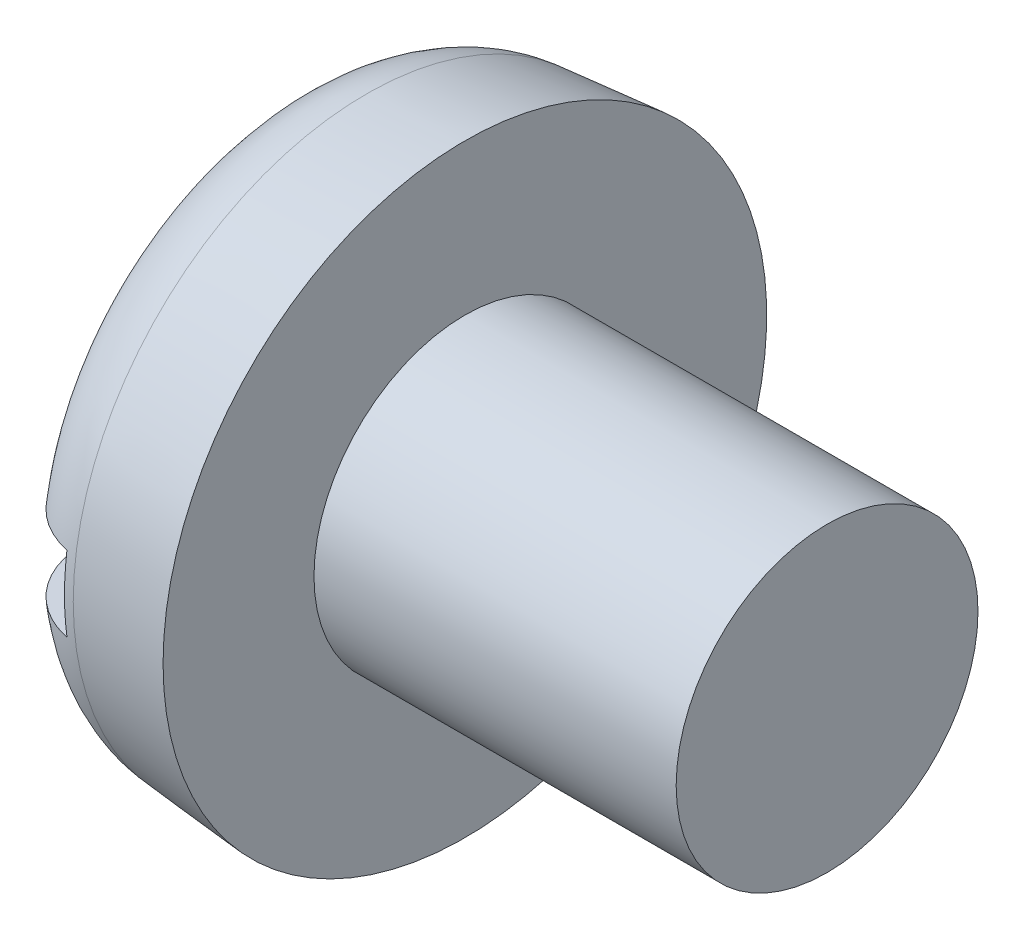
ISO-10303-21;
HEADER;
FILE_DESCRIPTION(('STEP AP214'),'2;1');
FILE_NAME('part.step','',(''),(''),'','','');
FILE_SCHEMA(('AUTOMOTIVE_DESIGN { 1 0 10303 214 1 1 1 1 }'));
ENDSEC;
DATA;
#1=APPLICATION_CONTEXT('core data for automotive mechanical design processes');
#2=APPLICATION_PROTOCOL_DEFINITION('international standard','automotive_design',2000,#1);
#3=PRODUCT_CONTEXT('',#1,'mechanical');
#4=PRODUCT('Part','Part','',(#3));
#5=PRODUCT_RELATED_PRODUCT_CATEGORY('part','',(#4));
#6=PRODUCT_DEFINITION_FORMATION('','',#4);
#7=PRODUCT_DEFINITION_CONTEXT('part definition',#1,'design');
#8=PRODUCT_DEFINITION('design','',#6,#7);
#9=PRODUCT_DEFINITION_SHAPE('','',#8);
#10=(LENGTH_UNIT() NAMED_UNIT(*) SI_UNIT(.MILLI.,.METRE.));
#11=(NAMED_UNIT(*) PLANE_ANGLE_UNIT() SI_UNIT($,.RADIAN.));
#12=(NAMED_UNIT(*) SI_UNIT($,.STERADIAN.) SOLID_ANGLE_UNIT());
#13=UNCERTAINTY_MEASURE_WITH_UNIT(LENGTH_MEASURE(1.E-05),#10,'distance_accuracy_value','');
#14=(GEOMETRIC_REPRESENTATION_CONTEXT(3) GLOBAL_UNCERTAINTY_ASSIGNED_CONTEXT((#13)) GLOBAL_UNIT_ASSIGNED_CONTEXT((#10,
#11,#12)) REPRESENTATION_CONTEXT('',''));
#15=CARTESIAN_POINT('',(0.,0.,0.));
#16=DIRECTION('',(0.,0.,1.));
#17=DIRECTION('',(1.,0.,0.));
#18=AXIS2_PLACEMENT_3D('',#15,#16,#17);
#19=CARTESIAN_POINT('',(0.,0.,0.));
#20=DIRECTION('',(-1.,0.,0.));
#21=DIRECTION('',(0.,0.,1.));
#22=AXIS2_PLACEMENT_3D('',#19,#20,#21);
#23=PLANE('',#22);
#24=DIRECTION('',(0.,0.,-1.));
#25=VECTOR('',#24,1.);
#26=CARTESIAN_POINT('',(0.,1.25,10.));
#27=LINE('',#26,#25);
#28=CARTESIAN_POINT('',(0.,1.25,6.60890143188702));
#29=VERTEX_POINT('',#28);
#30=CARTESIAN_POINT('',(0.,1.25,-6.60890143188702));
#31=VERTEX_POINT('',#30);
#32=EDGE_CURVE('E85',#29,#31,#27,.T.);
#33=ORIENTED_EDGE('',*,*,#32,.F.);
#34=CARTESIAN_POINT('',(0.,0.,0.));
#35=DIRECTION('',(-1.,0.,0.));
#36=DIRECTION('',(0.,0.,1.));
#37=AXIS2_PLACEMENT_3D('',#34,#35,#36);
#38=CIRCLE('',#37,6.72607449679219);
#39=EDGE_CURVE('E91',#29,#31,#38,.T.);
#40=ORIENTED_EDGE('',*,*,#39,.T.);
#41=EDGE_LOOP('',(#33,#40));
#42=FACE_BOUND('',#41,.T.);
#43=ADVANCED_FACE('F32',(#42),#23,.T.);
#44=CARTESIAN_POINT('',(-25.4,0.,0.));
#45=DIRECTION('',(-1.,0.,0.));
#46=DIRECTION('',(0.,0.,1.));
#47=AXIS2_PLACEMENT_3D('',#44,#45,#46);
#48=CYLINDRICAL_SURFACE('',#47,5.);
#49=CARTESIAN_POINT('',(18.,0.,0.));
#50=DIRECTION('',(-1.,0.,0.));
#51=DIRECTION('',(0.,0.,1.));
#52=AXIS2_PLACEMENT_3D('',#49,#50,#51);
#53=CIRCLE('',#52,5.);
#54=CARTESIAN_POINT('',(18.,0.,5.));
#55=VERTEX_POINT('',#54);
#56=EDGE_CURVE('E92',#55,#55,#53,.T.);
#57=ORIENTED_EDGE('',*,*,#56,.T.);
#58=EDGE_LOOP('',(#57));
#59=FACE_BOUND('',#58,.T.);
#60=CARTESIAN_POINT('',(6.,0.,0.));
#61=DIRECTION('',(-1.,0.,0.));
#62=DIRECTION('',(0.,0.,1.));
#63=AXIS2_PLACEMENT_3D('',#60,#61,#62);
#64=CIRCLE('',#63,5.);
#65=CARTESIAN_POINT('',(6.,0.,5.));
#66=VERTEX_POINT('',#65);
#67=EDGE_CURVE('E149',#66,#66,#64,.T.);
#68=ORIENTED_EDGE('',*,*,#67,.F.);
#69=EDGE_LOOP('',(#68));
#70=FACE_BOUND('',#69,.T.);
#71=ADVANCED_FACE('F137',(#59,#70),#48,.T.);
#72=CARTESIAN_POINT('',(18.,5.,0.));
#73=DIRECTION('',(1.,0.,0.));
#74=DIRECTION('',(0.,0.,-1.));
#75=AXIS2_PLACEMENT_3D('',#72,#73,#74);
#76=PLANE('',#75);
#77=ORIENTED_EDGE('',*,*,#56,.F.);
#78=EDGE_LOOP('',(#77));
#79=FACE_BOUND('',#78,.T.);
#80=ADVANCED_FACE('F135',(#79),#76,.T.);
#81=DIRECTION('',(0.,0.,1.));
#82=VECTOR('',#81,1.);
#83=CARTESIAN_POINT('',(0.,-1.25,-10.));
#84=LINE('',#83,#82);
#85=CARTESIAN_POINT('',(0.,-1.25,-6.60890143188702));
#86=VERTEX_POINT('',#85);
#87=CARTESIAN_POINT('',(0.,-1.25,6.60890143188702));
#88=VERTEX_POINT('',#87);
#89=EDGE_CURVE('E76',#86,#88,#84,.T.);
#90=ORIENTED_EDGE('',*,*,#89,.F.);
#91=EDGE_CURVE('E83',#86,#88,#38,.T.);
#92=ORIENTED_EDGE('',*,*,#91,.T.);
#93=EDGE_LOOP('',(#90,#92));
#94=FACE_BOUND('',#93,.T.);
#95=ADVANCED_FACE('F82',(#94),#23,.T.);
#96=CARTESIAN_POINT('',(0.,0.,0.));
#97=DIRECTION('',(1.,0.,0.));
#98=DIRECTION('',(0.,0.,-1.));
#99=AXIS2_PLACEMENT_3D('',#96,#97,#98);
#100=CONICAL_SURFACE('',#99,9.47506801884446,0.0872664625997167);
#101=CARTESIAN_POINT('',(2.73853277175704,0.,0.));
#102=DIRECTION('',(-1.,0.,0.));
#103=DIRECTION('',(0.,0.,1.));
#104=AXIS2_PLACEMENT_3D('',#101,#102,#103);
#105=CIRCLE('',#104,9.71465859106742);
#106=CARTESIAN_POINT('',(2.73853277175704,0.,9.71465859106742));
#107=VERTEX_POINT('',#106);
#108=EDGE_CURVE('E95',#107,#107,#105,.F.);
#109=ORIENTED_EDGE('',*,*,#108,.T.);
#110=EDGE_LOOP('',(#109));
#111=FACE_BOUND('',#110,.T.);
#112=CARTESIAN_POINT('',(6.,0.,0.));
#113=DIRECTION('',(-1.,0.,0.));
#114=DIRECTION('',(0.,0.,1.));
#115=AXIS2_PLACEMENT_3D('',#112,#113,#114);
#116=CIRCLE('',#115,10.);
#117=CARTESIAN_POINT('',(6.,0.,10.));
#118=VERTEX_POINT('',#117);
#119=EDGE_CURVE('E97',#118,#118,#116,.T.);
#120=ORIENTED_EDGE('',*,*,#119,.T.);
#121=EDGE_LOOP('',(#120));
#122=FACE_BOUND('',#121,.T.);
#123=ADVANCED_FACE('F128',(#111,#122),#100,.T.);
#124=CARTESIAN_POINT('',(6.,5.,0.));
#125=DIRECTION('',(-1.,0.,0.));
#126=DIRECTION('',(0.,0.,1.));
#127=AXIS2_PLACEMENT_3D('',#124,#125,#126);
#128=PLANE('',#127);
#129=ORIENTED_EDGE('',*,*,#119,.F.);
#130=EDGE_LOOP('',(#129));
#131=FACE_BOUND('',#130,.T.);
#132=ORIENTED_EDGE('',*,*,#67,.T.);
#133=EDGE_LOOP('',(#132));
#134=FACE_BOUND('',#133,.T.);
#135=ADVANCED_FACE('F124',(#131,#134),#128,.F.);
#136=CARTESIAN_POINT('',(3.,0.,0.));
#137=DIRECTION('',(-1.,0.,0.));
#138=DIRECTION('',(0.,0.,1.));
#139=AXIS2_PLACEMENT_3D('',#136,#137,#138);
#140=TOROIDAL_SURFACE('',#139,6.72607449679219,3.);
#141=CARTESIAN_POINT('',(0.913950370637109,1.25,-8.79369083128901));
#142=CARTESIAN_POINT('',(1.03407751130377,1.25,-8.91107806132142));
#143=CARTESIAN_POINT('',(1.16414710380207,1.25,-9.0184570237587));
#144=CARTESIAN_POINT('',(1.44055548040903,1.25,-9.20996884049512));
#145=CARTESIAN_POINT('',(1.58691212679928,1.25,-9.29407581260138));
#146=CARTESIAN_POINT('',(1.89167269673039,1.25,-9.43645928294605));
#147=CARTESIAN_POINT('',(2.0500739357299,1.25,-9.49474151743692));
#148=CARTESIAN_POINT('',(2.37439631699175,1.25,-9.58375548275899));
#149=CARTESIAN_POINT('',(2.54031567881057,1.25,-9.61449370111562));
#150=CARTESIAN_POINT('',(2.87435662350507,1.25,-9.64747712365223));
#151=CARTESIAN_POINT('',(3.04246808407952,1.25,-9.64982487020966));
#152=CARTESIAN_POINT('',(3.37669612695632,1.25,-9.62622242478128));
#153=CARTESIAN_POINT('',(3.54281266818427,1.25,-9.60027165114961));
#154=CARTESIAN_POINT('',(3.8681098663374,1.25,-9.52088746536866));
#155=CARTESIAN_POINT('',(4.02729932442789,1.25,-9.46749010098248));
#156=CARTESIAN_POINT('',(4.33448631065542,1.25,-9.33479520222095));
#157=CARTESIAN_POINT('',(4.48248380541743,1.25,-9.25549759061341));
#158=CARTESIAN_POINT('',(4.76352766880619,1.25,-9.07306642098115));
#159=CARTESIAN_POINT('',(4.89653363801115,1.25,-8.96987064210604));
#160=CARTESIAN_POINT('',(5.14347241464919,1.25,-8.74274923983966));
#161=CARTESIAN_POINT('',(5.25740480355147,1.25,-8.61882316168355));
#162=CARTESIAN_POINT('',(5.46381187653993,1.25,-8.35290133451653));
#163=CARTESIAN_POINT('',(5.5561381014362,1.25,-8.21079038299477));
#164=CARTESIAN_POINT('',(5.71591382641562,1.25,-7.91321813905344));
#165=CARTESIAN_POINT('',(5.78336219693195,1.25,-7.75775624083566));
#166=CARTESIAN_POINT('',(5.89229296716758,1.25,-7.43609765141166));
#167=CARTESIAN_POINT('',(5.93348408672347,1.25,-7.26980235780456));
#168=CARTESIAN_POINT('',(5.98780094027136,1.25,-6.93269546295164));
#169=CARTESIAN_POINT('',(6.00092472704265,1.25,-6.76188354918954));
#170=CARTESIAN_POINT('',(5.99895954791929,1.25,-6.41790932325796));
#171=CARTESIAN_POINT('',(5.98345242956866,1.25,-6.24474942607715));
#172=CARTESIAN_POINT('',(5.9240547697785,1.25,-5.90336911532406));
#173=CARTESIAN_POINT('',(5.88016160637908,1.25,-5.73514915954457));
#174=CARTESIAN_POINT('',(5.76444528394465,1.25,-5.40563318621168));
#175=CARTESIAN_POINT('',(5.69219500815642,1.25,-5.24448707939763));
#176=CARTESIAN_POINT('',(5.52187152839524,1.25,-4.93645275143297));
#177=CARTESIAN_POINT('',(5.42379531610836,1.25,-4.78956619402467));
#178=CARTESIAN_POINT('',(5.20362037162036,1.25,-4.51322087856389));
#179=CARTESIAN_POINT('',(5.08134720862953,1.25,-4.38390089873516));
#180=CARTESIAN_POINT('',(4.81646755611421,1.25,-4.14804563021094));
#181=CARTESIAN_POINT('',(4.67386150920101,1.25,-4.04150984566958));
#182=CARTESIAN_POINT('',(4.37493583595242,1.25,-3.85675206013619));
#183=CARTESIAN_POINT('',(4.21891607377839,1.25,-3.7780461149527));
#184=CARTESIAN_POINT('',(3.89540554802636,1.25,-3.64953247185818));
#185=CARTESIAN_POINT('',(3.72792001916016,1.25,-3.59971168347483));
#186=CARTESIAN_POINT('',(3.39522326999832,1.25,-3.53305783519263));
#187=CARTESIAN_POINT('',(3.23031745969932,1.25,-3.51469914474808));
#188=CARTESIAN_POINT('',(2.89985413069661,1.25,-3.50709369984232));
#189=CARTESIAN_POINT('',(2.73429676976369,1.25,-3.51784028444378));
#190=CARTESIAN_POINT('',(2.41348778299921,1.25,-3.56699036741715));
#191=CARTESIAN_POINT('',(2.25807967950541,1.25,-3.60438488121367));
#192=CARTESIAN_POINT('',(1.95549755522285,1.25,-3.70411822509696));
#193=CARTESIAN_POINT('',(1.80832473539396,1.25,-3.76646068261804));
#194=CARTESIAN_POINT('',(1.52239485860973,1.25,-3.91558892224511));
#195=CARTESIAN_POINT('',(1.38392868870966,1.25,-4.00293114892807));
#196=CARTESIAN_POINT('',(1.12266061046804,1.25,-4.19852761274049));
#197=CARTESIAN_POINT('',(0.999862193562184,1.25,-4.30678649751603));
#198=CARTESIAN_POINT('',(0.766801818650841,1.25,-4.54725082549057));
#199=CARTESIAN_POINT('',(0.657519290944068,1.25,-4.68040649001058));
#200=CARTESIAN_POINT('',(0.462072911149952,1.25,-4.96272965499895));
#201=CARTESIAN_POINT('',(0.375912926633934,1.25,-5.11189982828501));
#202=CARTESIAN_POINT('',(0.226781782891288,1.25,-5.42688300195218));
#203=CARTESIAN_POINT('',(0.164574583157254,1.25,-5.59305850661094));
#204=CARTESIAN_POINT('',(0.0689385441878412,1.25,-5.93349549898356));
#205=CARTESIAN_POINT('',(0.0355092666844694,1.25,-6.10775686351272));
#206=CARTESIAN_POINT('',(-0.00141343103443004,1.25,-6.45940175701318));
#207=CARTESIAN_POINT('',(-0.00491262898250947,1.25,-6.636784676771));
#208=CARTESIAN_POINT('',(0.0183732174024274,1.25,-6.98960681097475));
#209=CARTESIAN_POINT('',(0.045163929218162,1.25,-7.16504565546567));
#210=CARTESIAN_POINT('',(0.127908491877246,1.25,-7.50633395335969));
#211=CARTESIAN_POINT('',(0.183455825943161,1.25,-7.67228216500717));
#212=CARTESIAN_POINT('',(0.322041684811761,1.25,-7.99211018071299));
#213=CARTESIAN_POINT('',(0.40504415457883,1.25,-8.14600548697529));
#214=CARTESIAN_POINT('',(0.560173287365899,1.25,-8.38236701226094));
#215=CARTESIAN_POINT('',(0.62466285593324,1.25,-8.46994047614879));
#216=CARTESIAN_POINT('',(0.762698375107589,1.25,-8.63763545899658));
#217=CARTESIAN_POINT('',(0.836244236403102,1.25,-8.71775705143182));
#218=CARTESIAN_POINT('',(0.913950370637109,1.25,-8.79369083128901));
#219=B_SPLINE_CURVE_WITH_KNOTS('',3,(#141,#142,#143,#144,#145,#146,#147,#148,#149,#150,#151,
#152,#153,#154,#155,#156,#157,#158,#159,#160,#161,#162,#163,#164,#165,#166,#167,#168,#169,#170,
#171,#172,#173,#174,#175,#176,#177,#178,#179,#180,#181,#182,#183,#184,#185,#186,#187,#188,#189,
#190,#191,#192,#193,#194,#195,#196,#197,#198,#199,#200,#201,#202,#203,#204,#205,#206,#207,#208,
#209,#210,#211,#212,#213,#214,#215,#216,#217,#218),.UNSPECIFIED.,.T.,.F.,(4,2,2,2,2,2,2,2,2,2,2,
2,2,2,2,2,2,2,2,2,2,2,2,2,2,2,2,2,2,2,2,2,2,2,2,2,2,2,4),(0.,0.503484154162442,1.00752603326543,
1.51145589718797,2.01526703776391,2.51725793779356,3.01925915590461,3.52060273469954,
4.02194780846897,4.52461314965636,5.02728951936335,5.53332459375003,6.0393826415844,
6.55096110344102,7.0625750558047,7.58172027137345,8.10091344615562,8.62824690708603,
9.15564182123356,9.68698702152262,10.2183206571223,10.7398986755371,11.2612401347262,
11.7564997004828,12.2516459323454,12.7289772083202,13.2063779135576,13.6953635033286,
14.1844578700852,14.6988978597672,15.2134238432352,15.7432176241734,16.2730033365734,
16.8026867763,17.3324693404094,17.8549592704749,18.3767657548957,18.7024556269399,
19.0281422873475),.UNSPECIFIED.);
#220=CARTESIAN_POINT('',(2.4,1.25,-9.58429232182582));
#221=VERTEX_POINT('',#220);
#222=EDGE_CURVE('E11',#31,#221,#219,.T.);
#223=ORIENTED_EDGE('',*,*,#222,.F.);
#224=ORIENTED_EDGE('',*,*,#39,.F.);
#225=CARTESIAN_POINT('',(1.42400410544714,1.25,3.98178611401085));
#226=CARTESIAN_POINT('',(1.5612667229127,1.25,3.89297012542962));
#227=CARTESIAN_POINT('',(1.70580035016197,1.25,3.81523437534233));
#228=CARTESIAN_POINT('',(2.00584163029249,1.25,3.68474127465647));
#229=CARTESIAN_POINT('',(2.16135542333277,1.25,3.63199802914649));
#230=CARTESIAN_POINT('',(2.47937427381411,1.25,3.55367301119874));
#231=CARTESIAN_POINT('',(2.64188954131776,1.25,3.52813240569149));
#232=CARTESIAN_POINT('',(2.96885435771794,1.25,3.50557748557998));
#233=CARTESIAN_POINT('',(3.13330332914991,1.25,3.50855486037059));
#234=CARTESIAN_POINT('',(3.45489323825768,1.25,3.54240853089129));
#235=CARTESIAN_POINT('',(3.61211260636177,1.25,3.57254854261386));
#236=CARTESIAN_POINT('',(3.91940624931825,1.25,3.65837971181245));
#237=CARTESIAN_POINT('',(4.06947936666885,1.25,3.71407499312618));
#238=CARTESIAN_POINT('',(4.36105131253355,1.25,3.84997531509812));
#239=CARTESIAN_POINT('',(4.50236952426379,1.25,3.93056672198312));
#240=CARTESIAN_POINT('',(4.77037282131814,1.25,4.1132046998502));
#241=CARTESIAN_POINT('',(4.89705478522829,1.25,4.21525583442383));
#242=CARTESIAN_POINT('',(5.13904911182896,1.25,4.44362846352343));
#243=CARTESIAN_POINT('',(5.25343578953125,1.25,4.57093155457726));
#244=CARTESIAN_POINT('',(5.46008362867014,1.25,4.84238649557124));
#245=CARTESIAN_POINT('',(5.55234077331088,1.25,4.98654139728032));
#246=CARTESIAN_POINT('',(5.71512091475504,1.25,5.29301673364416));
#247=CARTESIAN_POINT('',(5.78479444490038,1.25,5.45578930160224));
#248=CARTESIAN_POINT('',(5.89593523694821,1.25,5.79070335295831));
#249=CARTESIAN_POINT('',(5.93740130855529,1.25,5.96284523139051));
#250=CARTESIAN_POINT('',(5.99085637776574,1.25,6.31223598795774));
#251=CARTESIAN_POINT('',(6.00274901050106,1.25,6.48949966253518));
#252=CARTESIAN_POINT('',(5.99618345776841,1.25,6.84347053478164));
#253=CARTESIAN_POINT('',(5.97772699776386,1.25,7.02017776351449));
#254=CARTESIAN_POINT('',(5.91120016365612,1.25,7.3655056514184));
#255=CARTESIAN_POINT('',(5.86352491612468,1.25,7.53420237810825));
#256=CARTESIAN_POINT('',(5.74006872714877,1.25,7.86098193149343));
#257=CARTESIAN_POINT('',(5.66429014861451,1.25,8.01906564920444));
#258=CARTESIAN_POINT('',(5.48810579850209,1.25,8.31744548780965));
#259=CARTESIAN_POINT('',(5.38811325325753,1.25,8.4579856429053));
#260=CARTESIAN_POINT('',(5.16566608133882,1.25,8.71999862859805));
#261=CARTESIAN_POINT('',(5.04321309685082,1.25,8.84147285198905));
#262=CARTESIAN_POINT('',(4.78105062596314,1.25,9.06026678761757));
#263=CARTESIAN_POINT('',(4.6415850635739,1.25,9.1578788435105));
#264=CARTESIAN_POINT('',(4.34813222762841,1.25,9.32806433190163));
#265=CARTESIAN_POINT('',(4.19414569661798,1.25,9.40063904382905));
#266=CARTESIAN_POINT('',(3.87745295144188,1.25,9.5180728669798));
#267=CARTESIAN_POINT('',(3.71483300145876,1.25,9.56316469943591));
#268=CARTESIAN_POINT('',(3.38431824439367,1.25,9.6252741915853));
#269=CARTESIAN_POINT('',(3.21642359332601,1.25,9.64229268083246));
#270=CARTESIAN_POINT('',(2.88090253851376,1.25,9.64774078403327));
#271=CARTESIAN_POINT('',(2.71327812808542,1.25,9.63629403619727));
#272=CARTESIAN_POINT('',(2.38233537100995,1.25,9.58540890722111));
#273=CARTESIAN_POINT('',(2.21901698410528,1.25,9.54597078787211));
#274=CARTESIAN_POINT('',(1.90136639243121,1.25,9.440278442531));
#275=CARTESIAN_POINT('',(1.74703114200579,1.25,9.37403336650221));
#276=CARTESIAN_POINT('',(1.45161989000497,1.25,9.21666160296893));
#277=CARTESIAN_POINT('',(1.31054399833104,1.25,9.12553470925355));
#278=CARTESIAN_POINT('',(1.04508569400981,1.25,8.92067026270615));
#279=CARTESIAN_POINT('',(0.920765151968029,1.25,8.80685255977891));
#280=CARTESIAN_POINT('',(0.69282275255856,1.25,8.56010291651837));
#281=CARTESIAN_POINT('',(0.58920150731778,1.25,8.42717041111526));
#282=CARTESIAN_POINT('',(0.404709376546608,1.25,8.14489607538399));
#283=CARTESIAN_POINT('',(0.324019714622909,1.25,7.99543583255841));
#284=CARTESIAN_POINT('',(0.188546673254066,1.25,7.68520850953716));
#285=CARTESIAN_POINT('',(0.133764680919071,1.25,7.52444082446439));
#286=CARTESIAN_POINT('',(0.0509263008805422,1.25,7.19412294861733));
#287=CARTESIAN_POINT('',(0.0231968290617239,1.25,7.02449081394862));
#288=CARTESIAN_POINT('',(-0.00385005373943917,1.25,6.68298800418002));
#289=CARTESIAN_POINT('',(-0.00316643097126078,1.25,6.51111724786003));
#290=CARTESIAN_POINT('',(0.02659266570176,1.25,6.16720755358592));
#291=CARTESIAN_POINT('',(0.0561017342399292,1.25,5.99520616080172));
#292=CARTESIAN_POINT('',(0.143149953845394,1.25,5.65840060390682));
#293=CARTESIAN_POINT('',(0.200698360477521,1.25,5.49359883592269));
#294=CARTESIAN_POINT('',(0.343213197801992,1.25,5.17328528078032));
#295=CARTESIAN_POINT('',(0.428585959112109,1.25,5.01795437994385));
#296=CARTESIAN_POINT('',(0.624063068990159,1.25,4.72386676316716));
#297=CARTESIAN_POINT('',(0.734143092105619,1.25,4.58509394945501));
#298=CARTESIAN_POINT('',(0.939954204163414,1.25,4.36648585706974));
#299=CARTESIAN_POINT('',(1.03018849186778,1.25,4.28140949294303));
#300=CARTESIAN_POINT('',(1.2202259805025,1.25,4.12269833615171));
#301=CARTESIAN_POINT('',(1.32002902167376,1.25,4.04906335251657));
#302=CARTESIAN_POINT('',(1.42400410544714,1.25,3.98178611401085));
#303=B_SPLINE_CURVE_WITH_KNOTS('',3,(#225,#226,#227,#228,#229,#230,#231,#232,#233,#234,#235,
#236,#237,#238,#239,#240,#241,#242,#243,#244,#245,#246,#247,#248,#249,#250,#251,#252,#253,#254,
#255,#256,#257,#258,#259,#260,#261,#262,#263,#264,#265,#266,#267,#268,#269,#270,#271,#272,#273,
#274,#275,#276,#277,#278,#279,#280,#281,#282,#283,#284,#285,#286,#287,#288,#289,#290,#291,#292,
#293,#294,#295,#296,#297,#298,#299,#300,#301,#302),.UNSPECIFIED.,.T.,.F.,(4,2,2,2,2,2,2,2,2,2,2,
2,2,2,2,2,2,2,2,2,2,2,2,2,2,2,2,2,2,2,2,2,2,2,2,2,2,2,4),(0.,0.490052283600538,
0.980380810918269,1.47145032380725,1.96237673537656,2.44038333120541,2.91846708979897,
3.40437848125001,3.89039331053407,4.40152059741941,4.91274059041699,5.44141242118504,
5.97010655940861,6.50052119996867,7.03090568544548,7.55427135175516,8.07759302378493,
8.59254557427598,9.10746048921212,9.61570935727125,10.1239322495399,10.6277895192064,
11.1316318998646,11.633289676473,12.1349427613559,12.6364247622586,13.1379109193765,
13.6412008900273,14.1445057419441,14.6516840179981,15.1588894455684,15.6721509466047,
16.1854311215946,16.7065528926029,17.2278467984661,17.7571227257298,18.2858798243091,
18.657095809829,19.0283055986377),.UNSPECIFIED.);
#304=CARTESIAN_POINT('',(2.4,1.25,9.58429232182582));
#305=VERTEX_POINT('',#304);
#306=EDGE_CURVE('E109',#305,#29,#303,.T.);
#307=ORIENTED_EDGE('',*,*,#306,.F.);
#308=CARTESIAN_POINT('',(2.4,0.,0.));
#309=DIRECTION('',(-1.,0.,0.));
#310=DIRECTION('',(0.,0.,1.));
#311=AXIS2_PLACEMENT_3D('',#308,#309,#310);
#312=CIRCLE('',#311,9.665462188132);
#313=CARTESIAN_POINT('',(2.4,-1.25,9.58429232182582));
#314=VERTEX_POINT('',#313);
#315=EDGE_CURVE('E103',#305,#314,#312,.F.);
#316=ORIENTED_EDGE('',*,*,#315,.T.);
#317=CARTESIAN_POINT('',(1.42400410544714,-1.25,3.98178611401085));
#318=CARTESIAN_POINT('',(1.27725127561659,-1.25,4.07675719307544));
#319=CARTESIAN_POINT('',(1.13859909454346,-1.25,4.18453932084327));
#320=CARTESIAN_POINT('',(0.881278241009851,-1.25,4.42203149164488));
#321=CARTESIAN_POINT('',(0.762645773515669,-1.25,4.55178043002595));
#322=CARTESIAN_POINT('',(0.548773727838207,-1.25,4.82899748680443));
#323=CARTESIAN_POINT('',(0.453498344640553,-1.25,4.97643796170688));
#324=CARTESIAN_POINT('',(0.288693181724799,-1.25,5.28498247620592));
#325=CARTESIAN_POINT('',(0.219153313620414,-1.25,5.44608113125858));
#326=CARTESIAN_POINT('',(0.106971060630565,-1.25,5.7798739795066));
#327=CARTESIAN_POINT('',(0.0647116174061697,-1.25,5.95269714216731));
#328=CARTESIAN_POINT('',(0.0100221516455754,-1.25,6.30302303408068));
#329=CARTESIAN_POINT('',(-0.00240602186251567,-1.25,6.48052605271495));
#330=CARTESIAN_POINT('',(0.00315593438058431,-1.25,6.83381450579847));
#331=CARTESIAN_POINT('',(0.0209325833469419,-1.25,7.00960323594976));
#332=CARTESIAN_POINT('',(0.0862335506761715,-1.25,7.35556997966074));
#333=CARTESIAN_POINT('',(0.133755356981427,-1.25,7.525748465743));
#334=CARTESIAN_POINT('',(0.25639134687769,-1.25,7.8527951656162));
#335=CARTESIAN_POINT('',(0.331058702722013,-1.25,8.00983092680331));
#336=CARTESIAN_POINT('',(0.506081815974611,-1.25,8.30887056544134));
#337=CARTESIAN_POINT('',(0.606435431482698,-1.25,8.45087569485662));
#338=CARTESIAN_POINT('',(0.828351275900086,-1.25,8.71360142573838));
#339=CARTESIAN_POINT('',(0.949576554233392,-1.25,8.83460669710879));
#340=CARTESIAN_POINT('',(1.21081660462411,-1.25,9.054274389535));
#341=CARTESIAN_POINT('',(1.35083022750591,-1.25,9.15293817610057));
#342=CARTESIAN_POINT('',(1.64402340293065,-1.25,9.32402645340221));
#343=CARTESIAN_POINT('',(1.79704381330649,-1.25,9.39672374157391));
#344=CARTESIAN_POINT('',(2.11317116743113,-1.25,9.51520554379536));
#345=CARTESIAN_POINT('',(2.27627769873803,-1.25,9.56099115751472));
#346=CARTESIAN_POINT('',(2.60681252412339,-1.25,9.6240827292451));
#347=CARTESIAN_POINT('',(2.77420606344936,-1.25,9.64157088293743));
#348=CARTESIAN_POINT('',(3.10954711723648,-1.25,9.64812292223042));
#349=CARTESIAN_POINT('',(3.27749462093093,-1.25,9.637187357054));
#350=CARTESIAN_POINT('',(3.60876227637355,-1.25,9.58727457880961));
#351=CARTESIAN_POINT('',(3.77209238437734,-1.25,9.54836339332095));
#352=CARTESIAN_POINT('',(4.0899162526486,-1.25,9.44371397716888));
#353=CARTESIAN_POINT('',(4.24441001749524,-1.25,9.37797576040788));
#354=CARTESIAN_POINT('',(4.5404588401466,-1.25,9.22146553365933));
#355=CARTESIAN_POINT('',(4.68199303277071,-1.25,9.13065406718835));
#356=CARTESIAN_POINT('',(4.94791239290047,-1.25,8.92668118546708));
#357=CARTESIAN_POINT('',(5.07229724303588,-1.25,8.81351935668935));
#358=CARTESIAN_POINT('',(5.30116231768633,-1.25,8.56741311121017));
#359=CARTESIAN_POINT('',(5.4055275652995,-1.25,8.43436179964002));
#360=CARTESIAN_POINT('',(5.59068859464117,-1.25,8.15276815715439));
#361=CARTESIAN_POINT('',(5.67148346947787,-1.25,8.00422523048315));
#362=CARTESIAN_POINT('',(5.80809437903581,-1.25,7.69433085350338));
#363=CARTESIAN_POINT('',(5.86365839564895,-1.25,7.53286834478914));
#364=CARTESIAN_POINT('',(5.94729502877717,-1.25,7.20297962350516));
#365=CARTESIAN_POINT('',(5.97536591418858,-1.25,7.03455297313439));
#366=CARTESIAN_POINT('',(6.00366240968885,-1.25,6.69303316179288));
#367=CARTESIAN_POINT('',(6.00349747753257,-1.25,6.51990767774181));
#368=CARTESIAN_POINT('',(5.97458490132084,-1.25,6.17606321667889));
#369=CARTESIAN_POINT('',(5.94583479374226,-1.25,6.00534444836831));
#370=CARTESIAN_POINT('',(5.86004783305121,-1.25,5.66826012054466));
#371=CARTESIAN_POINT('',(5.80256656376348,-1.25,5.50200762537742));
#372=CARTESIAN_POINT('',(5.66082163154348,-1.25,5.18132875742744));
#373=CARTESIAN_POINT('',(5.57655497493284,-1.25,5.02690370893872));
#374=CARTESIAN_POINT('',(5.38247308033943,-1.25,4.73255054756707));
#375=CARTESIAN_POINT('',(5.27238473075299,-1.25,4.5928023053468));
#376=CARTESIAN_POINT('',(5.0301036818136,-1.25,4.33394617400635));
#377=CARTESIAN_POINT('',(4.89790962616484,-1.25,4.21483955226665));
#378=CARTESIAN_POINT('',(4.61627663685663,-1.25,4.00224187731544));
#379=CARTESIAN_POINT('',(4.46701558428916,-1.25,3.90851571787536));
#380=CARTESIAN_POINT('',(4.15433964011572,-1.25,3.7487749418487));
#381=CARTESIAN_POINT('',(3.99093056617049,-1.25,3.68274899961794));
#382=CARTESIAN_POINT('',(3.66220213091781,-1.25,3.58358623000525));
#383=CARTESIAN_POINT('',(3.49727931125113,-1.25,3.54913656154414));
#384=CARTESIAN_POINT('',(3.16391164119489,-1.25,3.50993553245585));
#385=CARTESIAN_POINT('',(2.99546709083191,-1.25,3.50518165221799));
#386=CARTESIAN_POINT('',(2.66816300358492,-1.25,3.52512294379722));
#387=CARTESIAN_POINT('',(2.50921866918726,-1.25,3.5484750693807));
#388=CARTESIAN_POINT('',(2.1975963726368,-1.25,3.62133535765784));
#389=CARTESIAN_POINT('',(2.0449113028569,-1.25,3.67081291449942));
#390=CARTESIAN_POINT('',(1.81492039683594,-1.25,3.7666537854903));
#391=CARTESIAN_POINT('',(1.73406893318829,-1.25,3.80476648475699));
#392=CARTESIAN_POINT('',(1.57610803565187,-1.25,3.88806663385249));
#393=CARTESIAN_POINT('',(1.49899834582075,-1.25,3.93325359889592));
#394=CARTESIAN_POINT('',(1.42400410544714,-1.25,3.98178611401085));
#395=B_SPLINE_CURVE_WITH_KNOTS('',3,(#317,#318,#319,#320,#321,#322,#323,#324,#325,#326,#327,
#328,#329,#330,#331,#332,#333,#334,#335,#336,#337,#338,#339,#340,#341,#342,#343,#344,#345,#346,
#347,#348,#349,#350,#351,#352,#353,#354,#355,#356,#357,#358,#359,#360,#361,#362,#363,#364,#365,
#366,#367,#368,#369,#370,#371,#372,#373,#374,#375,#376,#377,#378,#379,#380,#381,#382,#383,#384,
#385,#386,#387,#388,#389,#390,#391,#392,#393,#394),.UNSPECIFIED.,.T.,.F.,(4,2,2,2,2,2,2,2,2,2,2,
2,2,2,2,2,2,2,2,2,2,2,2,2,2,2,2,2,2,2,2,2,2,2,2,2,2,2,4),(0.,0.524069174246351,1.04907618231563,
1.57327328167665,2.09726467625818,2.62846011378424,3.15968847548497,3.68717783457722,
4.21462265180022,4.73375188308967,5.25283783984358,5.76421810763988,6.27556711147363,
6.78137400410924,7.28716022693675,7.78967675270799,8.29218356857681,8.79350825357432,
9.29483267877363,9.79695055355615,10.2990777194174,10.8040076083957,11.3089569224551,
11.8188445866453,12.3287643538239,12.8457376119362,13.3627554276193,13.8880301935503,
14.4133636876578,14.94452627241,15.4757214586132,16.0018132171634,16.5276896651787,
17.0305528098755,17.5333732873577,18.013090903165,18.4922477742392,18.7600781252942,
19.0278901304951),.UNSPECIFIED.);
#396=EDGE_CURVE('E90',#88,#314,#395,.T.);
#397=ORIENTED_EDGE('',*,*,#396,.F.);
#398=ORIENTED_EDGE('',*,*,#91,.F.);
#399=CARTESIAN_POINT('',(0.913950370637109,-1.25,-8.79369083128901));
#400=CARTESIAN_POINT('',(0.79210800781885,-1.25,-8.67460585655996));
#401=CARTESIAN_POINT('',(0.680316112691916,-1.25,-8.54504497000982));
#402=CARTESIAN_POINT('',(0.480067419708489,-1.25,-8.26882508188627));
#403=CARTESIAN_POINT('',(0.391641995055005,-1.25,-8.12214346991843));
#404=CARTESIAN_POINT('',(0.240686044541178,-1.25,-7.81619154519442));
#405=CARTESIAN_POINT('',(0.178129018543636,-1.25,-7.65693431541296));
#406=CARTESIAN_POINT('',(0.0803669576582259,-1.25,-7.33029737285594));
#407=CARTESIAN_POINT('',(0.0451550928404899,-1.25,-7.16291969940638));
#408=CARTESIAN_POINT('',(0.00258611923586783,-1.25,-6.8229389326814));
#409=CARTESIAN_POINT('',(-0.00448488125149468,-1.25,-6.6503000607524));
#410=CARTESIAN_POINT('',(0.00997611975284947,-1.25,-6.30622052494979));
#411=CARTESIAN_POINT('',(0.0315117109070497,-1.25,-6.13478001416495));
#412=CARTESIAN_POINT('',(0.102962056469544,-1.25,-5.79506095297794));
#413=CARTESIAN_POINT('',(0.153323793792893,-1.25,-5.62687639276569));
#414=CARTESIAN_POINT('',(0.281213942835532,-1.25,-5.30116605764274));
#415=CARTESIAN_POINT('',(0.35874520509128,-1.25,-5.14364140320381));
#416=CARTESIAN_POINT('',(0.539940365929153,-1.25,-4.84173125808695));
#417=CARTESIAN_POINT('',(0.643916262523444,-1.25,-4.69753282569381));
#418=CARTESIAN_POINT('',(0.87472909336041,-1.25,-4.42872178955582));
#419=CARTESIAN_POINT('',(1.00156786660067,-1.25,-4.30411076285339));
#420=CARTESIAN_POINT('',(1.27395739823677,-1.25,-4.07913796412561));
#421=CARTESIAN_POINT('',(1.4193931540524,-1.25,-3.97863724888694));
#422=CARTESIAN_POINT('',(1.72562266065984,-1.25,-3.80464237869568));
#423=CARTESIAN_POINT('',(1.88641172992237,-1.25,-3.73114002433063));
#424=CARTESIAN_POINT('',(2.21202201587971,-1.25,-3.61665234555964));
#425=CARTESIAN_POINT('',(2.37642863184726,-1.25,-3.57449018551097));
#426=CARTESIAN_POINT('',(2.71009270722816,-1.25,-3.52000714838046));
#427=CARTESIAN_POINT('',(2.87934814614393,-1.25,-3.50767401945693));
#428=CARTESIAN_POINT('',(3.20890035190914,-1.25,-3.51330262584549));
#429=CARTESIAN_POINT('',(3.36922441384706,-1.25,-3.52978963342363));
#430=CARTESIAN_POINT('',(3.68480899899293,-1.25,-3.58947417599334));
#431=CARTESIAN_POINT('',(3.84006927498456,-1.25,-3.6326730130197));
#432=CARTESIAN_POINT('',(4.14135724051155,-1.25,-3.74396700772008));
#433=CARTESIAN_POINT('',(4.28738453598471,-1.25,-3.81206322717045));
#434=CARTESIAN_POINT('',(4.56668164533951,-1.25,-3.97069487609764));
#435=CARTESIAN_POINT('',(4.69994881758002,-1.25,-4.06123493810591));
#436=CARTESIAN_POINT('',(4.95679363758762,-1.25,-4.26685011274988));
#437=CARTESIAN_POINT('',(5.07959092482132,-1.25,-4.38290006840786));
#438=CARTESIAN_POINT('',(5.30493997014551,-1.25,-4.63322745989246));
#439=CARTESIAN_POINT('',(5.40748756538978,-1.25,-4.76750863406115));
#440=CARTESIAN_POINT('',(5.59366085318471,-1.25,-5.05663627444271));
#441=CARTESIAN_POINT('',(5.67631915861419,-1.25,-5.21210682159418));
#442=CARTESIAN_POINT('',(5.81467598810081,-1.25,-5.53462223739534));
#443=CARTESIAN_POINT('',(5.87037241533421,-1.25,-5.7016680050948));
#444=CARTESIAN_POINT('',(5.95354424066536,-1.25,-6.04446969940737));
#445=CARTESIAN_POINT('',(5.98072576813777,-1.25,-6.22029713019131));
#446=CARTESIAN_POINT('',(6.00484460395591,-1.25,-6.57402140571999));
#447=CARTESIAN_POINT('',(6.00178308623164,-1.25,-6.75191816987268));
#448=CARTESIAN_POINT('',(5.96544964890179,-1.25,-7.1026892357492));
#449=CARTESIAN_POINT('',(5.93250012139393,-1.25,-7.27559686157046));
#450=CARTESIAN_POINT('',(5.83755669517072,-1.25,-7.61324983947616));
#451=CARTESIAN_POINT('',(5.77556521745272,-1.25,-7.77799587066252));
#452=CARTESIAN_POINT('',(5.62538756288191,-1.25,-8.09181782842832));
#453=CARTESIAN_POINT('',(5.53763971354797,-1.25,-8.24110353249325));
#454=CARTESIAN_POINT('',(5.3379902726797,-1.25,-8.52254424404731));
#455=CARTESIAN_POINT('',(5.22609051157747,-1.25,-8.65470054853016));
#456=CARTESIAN_POINT('',(4.98302054019751,-1.25,-8.89619706748367));
#457=CARTESIAN_POINT('',(4.8521409873904,-1.25,-9.0058298986329));
#458=CARTESIAN_POINT('',(4.57368157138682,-1.25,-9.20130833989561));
#459=CARTESIAN_POINT('',(4.42610262454865,-1.25,-9.28715525434077));
#460=CARTESIAN_POINT('',(4.11998467348535,-1.25,-9.43178407358196));
#461=CARTESIAN_POINT('',(3.9615657376515,-1.25,-9.4908201929738));
#462=CARTESIAN_POINT('',(3.63704088681896,-1.25,-9.58129312699364));
#463=CARTESIAN_POINT('',(3.47093555367944,-1.25,-9.61273202714089));
#464=CARTESIAN_POINT('',(3.13672613533401,-1.25,-9.64698870770106));
#465=CARTESIAN_POINT('',(2.96863804993791,-1.25,-9.64996282009419));
#466=CARTESIAN_POINT('',(2.63430914802866,-1.25,-9.62760456868871));
#467=CARTESIAN_POINT('',(2.46806879080234,-1.25,-9.60226531926938));
#468=CARTESIAN_POINT('',(2.14236298911523,-1.25,-9.52406247452959));
#469=CARTESIAN_POINT('',(1.98289192671315,-1.25,-9.47122220563716));
#470=CARTESIAN_POINT('',(1.6752016527585,-1.25,-9.33960757252021));
#471=CARTESIAN_POINT('',(1.52696872674259,-1.25,-9.26086546551841));
#472=CARTESIAN_POINT('',(1.3015926323395,-1.25,-9.11576211220805));
#473=CARTESIAN_POINT('',(1.21955219796268,-1.25,-9.05685576010763));
#474=CARTESIAN_POINT('',(1.06181593231143,-1.25,-8.9310883341524));
#475=CARTESIAN_POINT('',(0.986120081373383,-1.25,-8.86422728495294));
#476=CARTESIAN_POINT('',(0.913950370637109,-1.25,-8.79369083128901));
#477=B_SPLINE_CURVE_WITH_KNOTS('',3,(#399,#400,#401,#402,#403,#404,#405,#406,#407,#408,#409,
#410,#411,#412,#413,#414,#415,#416,#417,#418,#419,#420,#421,#422,#423,#424,#425,#426,#427,#428,
#429,#430,#431,#432,#433,#434,#435,#436,#437,#438,#439,#440,#441,#442,#443,#444,#445,#446,#447,
#448,#449,#450,#451,#452,#453,#454,#455,#456,#457,#458,#459,#460,#461,#462,#463,#464,#465,#466,
#467,#468,#469,#470,#471,#472,#473,#474,#475,#476),.UNSPECIFIED.,.T.,.F.,(4,2,2,2,2,2,2,2,2,2,2,
2,2,2,2,2,2,2,2,2,2,2,2,2,2,2,2,2,2,2,2,2,2,2,2,2,2,2,4),(0.,0.510743525690568,1.02216936099458,
1.53306997507299,2.04384294175473,2.55979587225403,3.07581355258018,3.60005824842006,
4.12435796275023,4.6551562763178,5.18599730422877,5.71370146849088,6.24124523602864,
6.74781079192076,7.25416824800074,7.73536780493781,8.21659081919593,8.69783435813468,
9.17917731119281,9.6838002388441,10.1885267969949,10.7143009080491,11.24011590196,
11.7712981755161,12.3024598305018,12.8279592791527,13.3534149288698,13.8704009750956,
14.3873478535821,14.8970819672734,15.4067881234968,15.9115549191953,16.4162835664301,
16.9182385829178,17.4203156980911,17.9219676426723,18.422997198239,18.7255219187176,
19.0280457015541),.UNSPECIFIED.);
#478=CARTESIAN_POINT('',(2.4,-1.25,-9.58429232182582));
#479=VERTEX_POINT('',#478);
#480=EDGE_CURVE('E44',#479,#86,#477,.T.);
#481=ORIENTED_EDGE('',*,*,#480,.F.);
#482=EDGE_CURVE('E56',#479,#221,#312,.F.);
#483=ORIENTED_EDGE('',*,*,#482,.T.);
#484=EDGE_LOOP('',(#223,#224,#307,#316,#397,#398,#481,#483));
#485=FACE_BOUND('',#484,.T.);
#486=ORIENTED_EDGE('',*,*,#108,.F.);
#487=EDGE_LOOP('',(#486));
#488=FACE_BOUND('',#487,.T.);
#489=ADVANCED_FACE('F34',(#485,#488),#140,.T.);
#490=CARTESIAN_POINT('',(2.4,1.25,10.));
#491=DIRECTION('',(0.,1.,0.));
#492=DIRECTION('',(0.,0.,1.));
#493=AXIS2_PLACEMENT_3D('',#490,#491,#492);
#494=PLANE('',#493);
#495=ORIENTED_EDGE('',*,*,#222,.T.);
#496=DIRECTION('',(0.,0.,-1.));
#497=VECTOR('',#496,1.);
#498=CARTESIAN_POINT('',(2.4,1.25,10.));
#499=LINE('',#498,#497);
#500=EDGE_CURVE('E84',#305,#221,#499,.T.);
#501=ORIENTED_EDGE('',*,*,#500,.F.);
#502=ORIENTED_EDGE('',*,*,#306,.T.);
#503=ORIENTED_EDGE('',*,*,#32,.T.);
#504=EDGE_LOOP('',(#495,#501,#502,#503));
#505=FACE_BOUND('',#504,.T.);
#506=ADVANCED_FACE('F116',(#505),#494,.F.);
#507=CARTESIAN_POINT('',(2.4,-1.25,-10.));
#508=DIRECTION('',(0.,-1.,0.));
#509=DIRECTION('',(0.,0.,-1.));
#510=AXIS2_PLACEMENT_3D('',#507,#508,#509);
#511=PLANE('',#510);
#512=ORIENTED_EDGE('',*,*,#480,.T.);
#513=ORIENTED_EDGE('',*,*,#89,.T.);
#514=ORIENTED_EDGE('',*,*,#396,.T.);
#515=DIRECTION('',(0.,0.,1.));
#516=VECTOR('',#515,1.);
#517=CARTESIAN_POINT('',(2.4,-1.25,-10.));
#518=LINE('',#517,#516);
#519=EDGE_CURVE('E51',#479,#314,#518,.T.);
#520=ORIENTED_EDGE('',*,*,#519,.F.);
#521=EDGE_LOOP('',(#512,#513,#514,#520));
#522=FACE_BOUND('',#521,.T.);
#523=ADVANCED_FACE('F75',(#522),#511,.F.);
#524=CARTESIAN_POINT('',(2.4,1.25,-10.));
#525=DIRECTION('',(-1.,0.,0.));
#526=DIRECTION('',(0.,0.,1.));
#527=AXIS2_PLACEMENT_3D('',#524,#525,#526);
#528=PLANE('',#527);
#529=ORIENTED_EDGE('',*,*,#519,.T.);
#530=ORIENTED_EDGE('',*,*,#315,.F.);
#531=ORIENTED_EDGE('',*,*,#500,.T.);
#532=ORIENTED_EDGE('',*,*,#482,.F.);
#533=EDGE_LOOP('',(#529,#530,#531,#532));
#534=FACE_BOUND('',#533,.T.);
#535=ADVANCED_FACE('F115',(#534),#528,.T.);
#536=CLOSED_SHELL('',(#43,#71,#80,#95,#123,#135,#489,#506,#523,#535));
#537=MANIFOLD_SOLID_BREP('B2',#536);
#538=ADVANCED_BREP_SHAPE_REPRESENTATION('',(#18,#537),#14);
#539=SHAPE_DEFINITION_REPRESENTATION(#9,#538);
ENDSEC;
END-ISO-10303-21;
